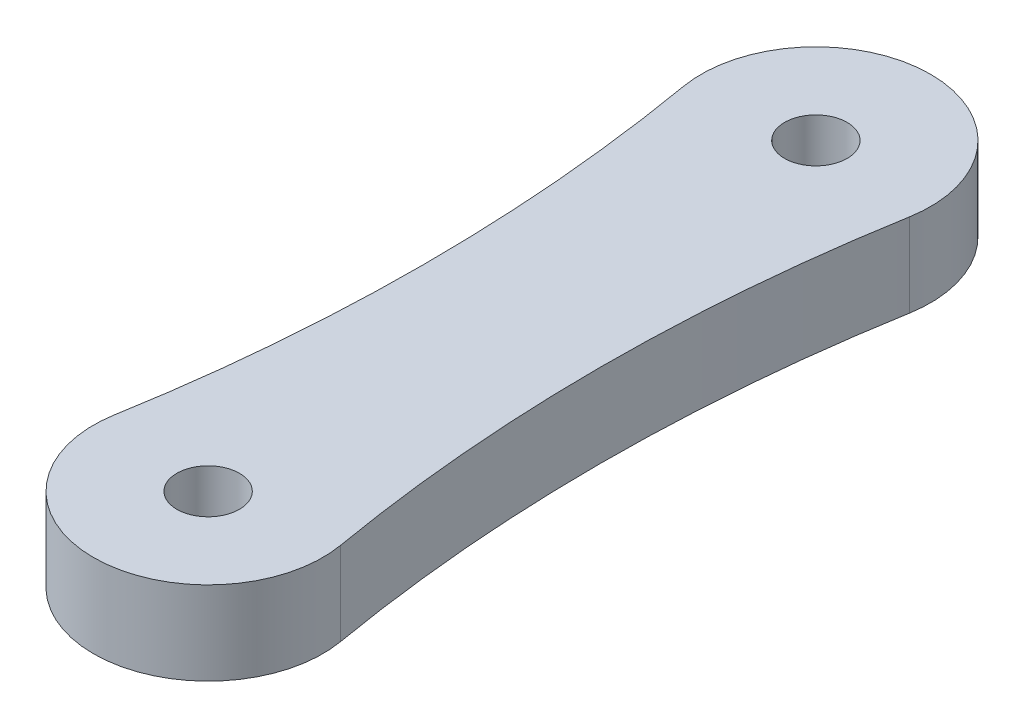
ISO-10303-21;
HEADER;
FILE_DESCRIPTION(('STEP AP214'),'2;1');
FILE_NAME('part.step','',(''),(''),'','','');
FILE_SCHEMA(('AUTOMOTIVE_DESIGN { 1 0 10303 214 1 1 1 1 }'));
ENDSEC;
DATA;
#1=APPLICATION_CONTEXT('core data for automotive mechanical design processes');
#2=APPLICATION_PROTOCOL_DEFINITION('international standard','automotive_design',2000,#1);
#3=PRODUCT_CONTEXT('',#1,'mechanical');
#4=PRODUCT('Part','Part','',(#3));
#5=PRODUCT_RELATED_PRODUCT_CATEGORY('part','',(#4));
#6=PRODUCT_DEFINITION_FORMATION('','',#4);
#7=PRODUCT_DEFINITION_CONTEXT('part definition',#1,'design');
#8=PRODUCT_DEFINITION('design','',#6,#7);
#9=PRODUCT_DEFINITION_SHAPE('','',#8);
#10=(LENGTH_UNIT() NAMED_UNIT(*) SI_UNIT(.MILLI.,.METRE.));
#11=(NAMED_UNIT(*) PLANE_ANGLE_UNIT() SI_UNIT($,.RADIAN.));
#12=(NAMED_UNIT(*) SI_UNIT($,.STERADIAN.) SOLID_ANGLE_UNIT());
#13=UNCERTAINTY_MEASURE_WITH_UNIT(LENGTH_MEASURE(1.E-05),#10,'distance_accuracy_value','');
#14=(GEOMETRIC_REPRESENTATION_CONTEXT(3) GLOBAL_UNCERTAINTY_ASSIGNED_CONTEXT((#13)) GLOBAL_UNIT_ASSIGNED_CONTEXT((#10,
#11,#12)) REPRESENTATION_CONTEXT('',''));
#15=CARTESIAN_POINT('',(0.,0.,0.));
#16=DIRECTION('',(0.,0.,1.));
#17=DIRECTION('',(1.,0.,0.));
#18=AXIS2_PLACEMENT_3D('',#15,#16,#17);
#19=CARTESIAN_POINT('',(-42.173625,4.,-7.28749999999999));
#20=DIRECTION('',(0.,-1.,0.));
#21=DIRECTION('',(0.,0.,-1.));
#22=AXIS2_PLACEMENT_3D('',#19,#20,#21);
#23=PLANE('',#22);
#24=CARTESIAN_POINT('',(-84.34725,4.,-14.575));
#25=DIRECTION('',(0.,-1.,0.));
#26=DIRECTION('',(0.,0.,-1.));
#27=AXIS2_PLACEMENT_3D('',#24,#25,#26);
#28=CIRCLE('',#27,80.09725);
#29=CARTESIAN_POINT('',(-5.41968199912965,4.,-28.2134921098517));
#30=VERTEX_POINT('',#29);
#31=CARTESIAN_POINT('',(-5.41968199912965,4.,-0.936507890148334));
#32=VERTEX_POINT('',#31);
#33=EDGE_CURVE('E85',#30,#32,#28,.T.);
#34=ORIENTED_EDGE('',*,*,#33,.T.);
#35=CARTESIAN_POINT('',(0.,4.,0.));
#36=DIRECTION('',(0.,1.,0.));
#37=DIRECTION('',(0.,0.,1.));
#38=AXIS2_PLACEMENT_3D('',#35,#36,#37);
#39=CIRCLE('',#38,5.5);
#40=CARTESIAN_POINT('',(5.41968199912964,4.,-0.936507890148373));
#41=VERTEX_POINT('',#40);
#42=EDGE_CURVE('E80',#32,#41,#39,.T.);
#43=ORIENTED_EDGE('',*,*,#42,.T.);
#44=CARTESIAN_POINT('',(84.34725,4.,-14.575));
#45=DIRECTION('',(0.,-1.,0.));
#46=DIRECTION('',(0.,0.,1.));
#47=AXIS2_PLACEMENT_3D('',#44,#45,#46);
#48=CIRCLE('',#47,80.09725);
#49=CARTESIAN_POINT('',(5.41968199912964,4.,-28.2134921098517));
#50=VERTEX_POINT('',#49);
#51=EDGE_CURVE('E83',#41,#50,#48,.T.);
#52=ORIENTED_EDGE('',*,*,#51,.T.);
#53=CARTESIAN_POINT('',(0.,4.,-29.15));
#54=DIRECTION('',(0.,1.,0.));
#55=DIRECTION('',(0.,0.,1.));
#56=AXIS2_PLACEMENT_3D('',#53,#54,#55);
#57=CIRCLE('',#56,5.5);
#58=EDGE_CURVE('E50',#50,#30,#57,.T.);
#59=ORIENTED_EDGE('',*,*,#58,.T.);
#60=EDGE_LOOP('',(#34,#43,#52,#59));
#61=FACE_BOUND('',#60,.T.);
#62=CARTESIAN_POINT('',(0.,4.,0.));
#63=DIRECTION('',(0.,1.,0.));
#64=DIRECTION('',(0.,0.,1.));
#65=AXIS2_PLACEMENT_3D('',#62,#63,#64);
#66=CIRCLE('',#65,1.5);
#67=CARTESIAN_POINT('',(0.,4.,1.5));
#68=VERTEX_POINT('',#67);
#69=EDGE_CURVE('E100',#68,#68,#66,.T.);
#70=ORIENTED_EDGE('',*,*,#69,.F.);
#71=EDGE_LOOP('',(#70));
#72=FACE_BOUND('',#71,.T.);
#73=CARTESIAN_POINT('',(0.,4.,-29.15));
#74=DIRECTION('',(0.,1.,0.));
#75=DIRECTION('',(0.,0.,1.));
#76=AXIS2_PLACEMENT_3D('',#73,#74,#75);
#77=CIRCLE('',#76,1.5);
#78=CARTESIAN_POINT('',(0.,4.,-27.65));
#79=VERTEX_POINT('',#78);
#80=EDGE_CURVE('E115',#79,#79,#77,.T.);
#81=ORIENTED_EDGE('',*,*,#80,.F.);
#82=EDGE_LOOP('',(#81));
#83=FACE_BOUND('',#82,.T.);
#84=ADVANCED_FACE('F33',(#61,#72,#83),#23,.F.);
#85=CARTESIAN_POINT('',(-42.173625,0.,-7.28749999999999));
#86=DIRECTION('',(0.,-1.,0.));
#87=DIRECTION('',(0.,0.,-1.));
#88=AXIS2_PLACEMENT_3D('',#85,#86,#87);
#89=PLANE('',#88);
#90=CARTESIAN_POINT('',(0.,0.,0.));
#91=DIRECTION('',(0.,1.,0.));
#92=DIRECTION('',(0.,0.,1.));
#93=AXIS2_PLACEMENT_3D('',#90,#91,#92);
#94=CIRCLE('',#93,1.5);
#95=CARTESIAN_POINT('',(0.,0.,1.5));
#96=VERTEX_POINT('',#95);
#97=EDGE_CURVE('E112',#96,#96,#94,.T.);
#98=ORIENTED_EDGE('',*,*,#97,.T.);
#99=EDGE_LOOP('',(#98));
#100=FACE_BOUND('',#99,.T.);
#101=CARTESIAN_POINT('',(-84.34725,0.,-14.575));
#102=DIRECTION('',(0.,-1.,0.));
#103=DIRECTION('',(0.,0.,-1.));
#104=AXIS2_PLACEMENT_3D('',#101,#102,#103);
#105=CIRCLE('',#104,80.09725);
#106=CARTESIAN_POINT('',(-5.41968199912965,0.,-28.2134921098517));
#107=VERTEX_POINT('',#106);
#108=CARTESIAN_POINT('',(-5.41968199912965,0.,-0.936507890148334));
#109=VERTEX_POINT('',#108);
#110=EDGE_CURVE('E97',#107,#109,#105,.T.);
#111=ORIENTED_EDGE('',*,*,#110,.F.);
#112=CARTESIAN_POINT('',(0.,0.,-29.15));
#113=DIRECTION('',(0.,1.,0.));
#114=DIRECTION('',(0.,0.,1.));
#115=AXIS2_PLACEMENT_3D('',#112,#113,#114);
#116=CIRCLE('',#115,5.5);
#117=CARTESIAN_POINT('',(5.41968199912964,0.,-28.2134921098517));
#118=VERTEX_POINT('',#117);
#119=EDGE_CURVE('E73',#118,#107,#116,.T.);
#120=ORIENTED_EDGE('',*,*,#119,.F.);
#121=CARTESIAN_POINT('',(84.34725,0.,-14.575));
#122=DIRECTION('',(0.,-1.,0.));
#123=DIRECTION('',(0.,0.,1.));
#124=AXIS2_PLACEMENT_3D('',#121,#122,#123);
#125=CIRCLE('',#124,80.09725);
#126=CARTESIAN_POINT('',(5.41968199912964,0.,-0.936507890148373));
#127=VERTEX_POINT('',#126);
#128=EDGE_CURVE('E67',#127,#118,#125,.T.);
#129=ORIENTED_EDGE('',*,*,#128,.F.);
#130=CARTESIAN_POINT('',(0.,0.,0.));
#131=DIRECTION('',(0.,1.,0.));
#132=DIRECTION('',(0.,0.,1.));
#133=AXIS2_PLACEMENT_3D('',#130,#131,#132);
#134=CIRCLE('',#133,5.5);
#135=EDGE_CURVE('E89',#109,#127,#134,.T.);
#136=ORIENTED_EDGE('',*,*,#135,.F.);
#137=EDGE_LOOP('',(#111,#120,#129,#136));
#138=FACE_BOUND('',#137,.T.);
#139=CARTESIAN_POINT('',(0.,0.,-29.15));
#140=DIRECTION('',(0.,1.,0.));
#141=DIRECTION('',(0.,0.,1.));
#142=AXIS2_PLACEMENT_3D('',#139,#140,#141);
#143=CIRCLE('',#142,1.5);
#144=CARTESIAN_POINT('',(0.,0.,-27.65));
#145=VERTEX_POINT('',#144);
#146=EDGE_CURVE('E118',#145,#145,#143,.T.);
#147=ORIENTED_EDGE('',*,*,#146,.T.);
#148=EDGE_LOOP('',(#147));
#149=FACE_BOUND('',#148,.T.);
#150=ADVANCED_FACE('F108',(#100,#138,#149),#89,.T.);
#151=CARTESIAN_POINT('',(-84.34725,4.,-14.575));
#152=DIRECTION('',(0.,-1.,0.));
#153=DIRECTION('',(0.,0.,-1.));
#154=AXIS2_PLACEMENT_3D('',#151,#152,#153);
#155=CYLINDRICAL_SURFACE('',#154,80.09725);
#156=ORIENTED_EDGE('',*,*,#110,.T.);
#157=DIRECTION('',(0.,-1.,0.));
#158=VECTOR('',#157,1.);
#159=CARTESIAN_POINT('',(-5.41968199912965,4.,-0.936507890148334));
#160=LINE('',#159,#158);
#161=EDGE_CURVE('E11',#32,#109,#160,.T.);
#162=ORIENTED_EDGE('',*,*,#161,.F.);
#163=ORIENTED_EDGE('',*,*,#33,.F.);
#164=DIRECTION('',(0.,-1.,0.));
#165=VECTOR('',#164,1.);
#166=CARTESIAN_POINT('',(-5.41968199912965,4.,-28.2134921098517));
#167=LINE('',#166,#165);
#168=EDGE_CURVE('E93',#30,#107,#167,.T.);
#169=ORIENTED_EDGE('',*,*,#168,.T.);
#170=EDGE_LOOP('',(#156,#162,#163,#169));
#171=FACE_BOUND('',#170,.T.);
#172=ADVANCED_FACE('F35',(#171),#155,.F.);
#173=CARTESIAN_POINT('',(0.,4.,0.));
#174=DIRECTION('',(0.,-1.,0.));
#175=DIRECTION('',(0.,0.,-1.));
#176=AXIS2_PLACEMENT_3D('',#173,#174,#175);
#177=CYLINDRICAL_SURFACE('',#176,5.5);
#178=ORIENTED_EDGE('',*,*,#135,.T.);
#179=DIRECTION('',(0.,-1.,0.));
#180=VECTOR('',#179,1.);
#181=CARTESIAN_POINT('',(5.41968199912964,4.,-0.936507890148373));
#182=LINE('',#181,#180);
#183=EDGE_CURVE('E42',#41,#127,#182,.T.);
#184=ORIENTED_EDGE('',*,*,#183,.F.);
#185=ORIENTED_EDGE('',*,*,#42,.F.);
#186=ORIENTED_EDGE('',*,*,#161,.T.);
#187=EDGE_LOOP('',(#178,#184,#185,#186));
#188=FACE_BOUND('',#187,.T.);
#189=ADVANCED_FACE('F88',(#188),#177,.T.);
#190=CARTESIAN_POINT('',(84.34725,4.,-14.575));
#191=DIRECTION('',(0.,-1.,0.));
#192=DIRECTION('',(0.,0.,-1.));
#193=AXIS2_PLACEMENT_3D('',#190,#191,#192);
#194=CYLINDRICAL_SURFACE('',#193,80.09725);
#195=ORIENTED_EDGE('',*,*,#128,.T.);
#196=DIRECTION('',(0.,-1.,0.));
#197=VECTOR('',#196,1.);
#198=CARTESIAN_POINT('',(5.41968199912964,4.,-28.2134921098517));
#199=LINE('',#198,#197);
#200=EDGE_CURVE('E90',#50,#118,#199,.T.);
#201=ORIENTED_EDGE('',*,*,#200,.F.);
#202=ORIENTED_EDGE('',*,*,#51,.F.);
#203=ORIENTED_EDGE('',*,*,#183,.T.);
#204=EDGE_LOOP('',(#195,#201,#202,#203));
#205=FACE_BOUND('',#204,.T.);
#206=ADVANCED_FACE('F91',(#205),#194,.F.);
#207=CARTESIAN_POINT('',(0.,4.,-29.15));
#208=DIRECTION('',(0.,-1.,0.));
#209=DIRECTION('',(0.,0.,-1.));
#210=AXIS2_PLACEMENT_3D('',#207,#208,#209);
#211=CYLINDRICAL_SURFACE('',#210,5.5);
#212=ORIENTED_EDGE('',*,*,#119,.T.);
#213=ORIENTED_EDGE('',*,*,#168,.F.);
#214=ORIENTED_EDGE('',*,*,#58,.F.);
#215=ORIENTED_EDGE('',*,*,#200,.T.);
#216=EDGE_LOOP('',(#212,#213,#214,#215));
#217=FACE_BOUND('',#216,.T.);
#218=ADVANCED_FACE('F105',(#217),#211,.T.);
#219=CARTESIAN_POINT('',(0.,4.,0.));
#220=DIRECTION('',(0.,-1.,0.));
#221=DIRECTION('',(0.,0.,-1.));
#222=AXIS2_PLACEMENT_3D('',#219,#220,#221);
#223=CYLINDRICAL_SURFACE('',#222,1.5);
#224=ORIENTED_EDGE('',*,*,#69,.T.);
#225=EDGE_LOOP('',(#224));
#226=FACE_BOUND('',#225,.T.);
#227=ORIENTED_EDGE('',*,*,#97,.F.);
#228=EDGE_LOOP('',(#227));
#229=FACE_BOUND('',#228,.T.);
#230=ADVANCED_FACE('F135',(#226,#229),#223,.F.);
#231=CARTESIAN_POINT('',(0.,4.,-29.15));
#232=DIRECTION('',(0.,-1.,0.));
#233=DIRECTION('',(0.,0.,-1.));
#234=AXIS2_PLACEMENT_3D('',#231,#232,#233);
#235=CYLINDRICAL_SURFACE('',#234,1.5);
#236=ORIENTED_EDGE('',*,*,#80,.T.);
#237=EDGE_LOOP('',(#236));
#238=FACE_BOUND('',#237,.T.);
#239=ORIENTED_EDGE('',*,*,#146,.F.);
#240=EDGE_LOOP('',(#239));
#241=FACE_BOUND('',#240,.T.);
#242=ADVANCED_FACE('F124',(#238,#241),#235,.F.);
#243=CLOSED_SHELL('',(#84,#150,#172,#189,#206,#218,#230,#242));
#244=MANIFOLD_SOLID_BREP('B2',#243);
#245=ADVANCED_BREP_SHAPE_REPRESENTATION('',(#18,#244),#14);
#246=SHAPE_DEFINITION_REPRESENTATION(#9,#245);
ENDSEC;
END-ISO-10303-21;
